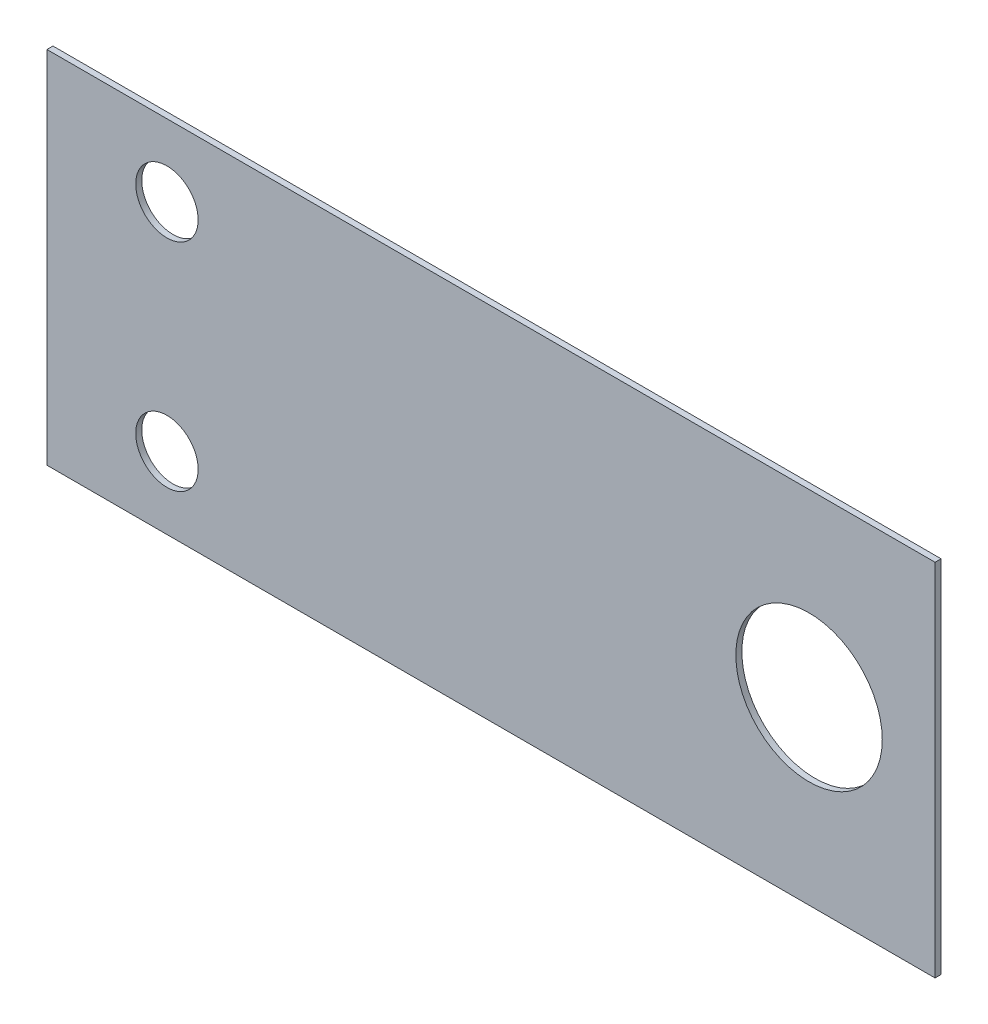
ISO-10303-21;
HEADER;
FILE_DESCRIPTION(('STEP AP214'),'2;1');
FILE_NAME('part.step','',(''),(''),'','','');
FILE_SCHEMA(('AUTOMOTIVE_DESIGN { 1 0 10303 214 1 1 1 1 }'));
ENDSEC;
DATA;
#1=APPLICATION_CONTEXT('core data for automotive mechanical design processes');
#2=APPLICATION_PROTOCOL_DEFINITION('international standard','automotive_design',2000,#1);
#3=PRODUCT_CONTEXT('',#1,'mechanical');
#4=PRODUCT('Part','Part','',(#3));
#5=PRODUCT_RELATED_PRODUCT_CATEGORY('part','',(#4));
#6=PRODUCT_DEFINITION_FORMATION('','',#4);
#7=PRODUCT_DEFINITION_CONTEXT('part definition',#1,'design');
#8=PRODUCT_DEFINITION('design','',#6,#7);
#9=PRODUCT_DEFINITION_SHAPE('','',#8);
#10=(LENGTH_UNIT() NAMED_UNIT(*) SI_UNIT(.MILLI.,.METRE.));
#11=(NAMED_UNIT(*) PLANE_ANGLE_UNIT() SI_UNIT($,.RADIAN.));
#12=(NAMED_UNIT(*) SI_UNIT($,.STERADIAN.) SOLID_ANGLE_UNIT());
#13=UNCERTAINTY_MEASURE_WITH_UNIT(LENGTH_MEASURE(1.E-05),#10,'distance_accuracy_value','');
#14=(GEOMETRIC_REPRESENTATION_CONTEXT(3) GLOBAL_UNCERTAINTY_ASSIGNED_CONTEXT((#13)) GLOBAL_UNIT_ASSIGNED_CONTEXT((#10,
#11,#12)) REPRESENTATION_CONTEXT('',''));
#15=CARTESIAN_POINT('',(0.,0.,0.));
#16=DIRECTION('',(0.,0.,1.));
#17=DIRECTION('',(1.,0.,0.));
#18=AXIS2_PLACEMENT_3D('',#15,#16,#17);
#19=CARTESIAN_POINT('',(37.,-15.,0.5));
#20=DIRECTION('',(-1.,0.,0.));
#21=DIRECTION('',(0.,0.,1.));
#22=AXIS2_PLACEMENT_3D('',#19,#20,#21);
#23=PLANE('',#22);
#24=DIRECTION('',(0.,1.,0.));
#25=VECTOR('',#24,1.);
#26=CARTESIAN_POINT('',(37.,-15.,0.));
#27=LINE('',#26,#25);
#28=CARTESIAN_POINT('',(37.,-15.,0.));
#29=VERTEX_POINT('',#28);
#30=CARTESIAN_POINT('',(37.,15.,0.));
#31=VERTEX_POINT('',#30);
#32=EDGE_CURVE('E99',#29,#31,#27,.T.);
#33=ORIENTED_EDGE('',*,*,#32,.T.);
#34=DIRECTION('',(0.,0.,-1.));
#35=VECTOR('',#34,1.);
#36=CARTESIAN_POINT('',(37.,15.,0.5));
#37=LINE('',#36,#35);
#38=CARTESIAN_POINT('',(37.,15.,0.5));
#39=VERTEX_POINT('',#38);
#40=EDGE_CURVE('E11',#39,#31,#37,.T.);
#41=ORIENTED_EDGE('',*,*,#40,.F.);
#42=DIRECTION('',(0.,1.,0.));
#43=VECTOR('',#42,1.);
#44=CARTESIAN_POINT('',(37.,-15.,0.5));
#45=LINE('',#44,#43);
#46=CARTESIAN_POINT('',(37.,-15.,0.5));
#47=VERTEX_POINT('',#46);
#48=EDGE_CURVE('E87',#47,#39,#45,.T.);
#49=ORIENTED_EDGE('',*,*,#48,.F.);
#50=DIRECTION('',(0.,0.,-1.));
#51=VECTOR('',#50,1.);
#52=CARTESIAN_POINT('',(37.,-15.,0.5));
#53=LINE('',#52,#51);
#54=EDGE_CURVE('E95',#47,#29,#53,.T.);
#55=ORIENTED_EDGE('',*,*,#54,.T.);
#56=EDGE_LOOP('',(#33,#41,#49,#55));
#57=FACE_BOUND('',#56,.T.);
#58=ADVANCED_FACE('F36',(#57),#23,.F.);
#59=CARTESIAN_POINT('',(-37.,15.,0.5));
#60=DIRECTION('',(0.,-1.,0.));
#61=DIRECTION('',(0.,0.,-1.));
#62=AXIS2_PLACEMENT_3D('',#59,#60,#61);
#63=PLANE('',#62);
#64=DIRECTION('',(-1.,0.,0.));
#65=VECTOR('',#64,1.);
#66=CARTESIAN_POINT('',(-37.,15.,0.));
#67=LINE('',#66,#65);
#68=CARTESIAN_POINT('',(-37.,15.,0.));
#69=VERTEX_POINT('',#68);
#70=EDGE_CURVE('E91',#31,#69,#67,.T.);
#71=ORIENTED_EDGE('',*,*,#70,.T.);
#72=DIRECTION('',(0.,0.,-1.));
#73=VECTOR('',#72,1.);
#74=CARTESIAN_POINT('',(-37.,15.,0.5));
#75=LINE('',#74,#73);
#76=CARTESIAN_POINT('',(-37.,15.,0.5));
#77=VERTEX_POINT('',#76);
#78=EDGE_CURVE('E44',#77,#69,#75,.T.);
#79=ORIENTED_EDGE('',*,*,#78,.F.);
#80=DIRECTION('',(-1.,0.,0.));
#81=VECTOR('',#80,1.);
#82=CARTESIAN_POINT('',(-37.,15.,0.5));
#83=LINE('',#82,#81);
#84=EDGE_CURVE('E82',#39,#77,#83,.T.);
#85=ORIENTED_EDGE('',*,*,#84,.F.);
#86=ORIENTED_EDGE('',*,*,#40,.T.);
#87=EDGE_LOOP('',(#71,#79,#85,#86));
#88=FACE_BOUND('',#87,.T.);
#89=ADVANCED_FACE('F90',(#88),#63,.F.);
#90=CARTESIAN_POINT('',(-37.,-15.,0.5));
#91=DIRECTION('',(1.,0.,0.));
#92=DIRECTION('',(0.,0.,-1.));
#93=AXIS2_PLACEMENT_3D('',#90,#91,#92);
#94=PLANE('',#93);
#95=DIRECTION('',(0.,-1.,0.));
#96=VECTOR('',#95,1.);
#97=CARTESIAN_POINT('',(-37.,-15.,0.));
#98=LINE('',#97,#96);
#99=CARTESIAN_POINT('',(-37.,-15.,0.));
#100=VERTEX_POINT('',#99);
#101=EDGE_CURVE('E69',#69,#100,#98,.T.);
#102=ORIENTED_EDGE('',*,*,#101,.T.);
#103=DIRECTION('',(0.,0.,-1.));
#104=VECTOR('',#103,1.);
#105=CARTESIAN_POINT('',(-37.,-15.,0.5));
#106=LINE('',#105,#104);
#107=CARTESIAN_POINT('',(-37.,-15.,0.5));
#108=VERTEX_POINT('',#107);
#109=EDGE_CURVE('E92',#108,#100,#106,.T.);
#110=ORIENTED_EDGE('',*,*,#109,.F.);
#111=DIRECTION('',(0.,-1.,0.));
#112=VECTOR('',#111,1.);
#113=CARTESIAN_POINT('',(-37.,-15.,0.5));
#114=LINE('',#113,#112);
#115=EDGE_CURVE('E85',#77,#108,#114,.T.);
#116=ORIENTED_EDGE('',*,*,#115,.F.);
#117=ORIENTED_EDGE('',*,*,#78,.T.);
#118=EDGE_LOOP('',(#102,#110,#116,#117));
#119=FACE_BOUND('',#118,.T.);
#120=ADVANCED_FACE('F93',(#119),#94,.F.);
#121=CARTESIAN_POINT('',(-37.,-15.,0.5));
#122=DIRECTION('',(0.,1.,0.));
#123=DIRECTION('',(0.,0.,1.));
#124=AXIS2_PLACEMENT_3D('',#121,#122,#123);
#125=PLANE('',#124);
#126=DIRECTION('',(1.,0.,0.));
#127=VECTOR('',#126,1.);
#128=CARTESIAN_POINT('',(-37.,-15.,0.));
#129=LINE('',#128,#127);
#130=EDGE_CURVE('E75',#100,#29,#129,.T.);
#131=ORIENTED_EDGE('',*,*,#130,.T.);
#132=ORIENTED_EDGE('',*,*,#54,.F.);
#133=DIRECTION('',(1.,0.,0.));
#134=VECTOR('',#133,1.);
#135=CARTESIAN_POINT('',(-37.,-15.,0.5));
#136=LINE('',#135,#134);
#137=EDGE_CURVE('E52',#108,#47,#136,.T.);
#138=ORIENTED_EDGE('',*,*,#137,.F.);
#139=ORIENTED_EDGE('',*,*,#109,.T.);
#140=EDGE_LOOP('',(#131,#132,#138,#139));
#141=FACE_BOUND('',#140,.T.);
#142=ADVANCED_FACE('F107',(#141),#125,.F.);
#143=CARTESIAN_POINT('',(0.,0.,0.5));
#144=DIRECTION('',(0.,0.,-1.));
#145=DIRECTION('',(-1.,0.,0.));
#146=AXIS2_PLACEMENT_3D('',#143,#144,#145);
#147=PLANE('',#146);
#148=CARTESIAN_POINT('',(26.5,0.,0.5));
#149=DIRECTION('',(0.,0.,1.));
#150=DIRECTION('',(1.,0.,0.));
#151=AXIS2_PLACEMENT_3D('',#148,#149,#150);
#152=CIRCLE('',#151,6.1);
#153=CARTESIAN_POINT('',(32.6,0.,0.5));
#154=VERTEX_POINT('',#153);
#155=EDGE_CURVE('E127',#154,#154,#152,.T.);
#156=ORIENTED_EDGE('',*,*,#155,.F.);
#157=EDGE_LOOP('',(#156));
#158=FACE_BOUND('',#157,.T.);
#159=CARTESIAN_POINT('',(-27.,-9.,0.500000000000001));
#160=DIRECTION('',(0.,0.,1.));
#161=DIRECTION('',(1.,0.,0.));
#162=AXIS2_PLACEMENT_3D('',#159,#160,#161);
#163=CIRCLE('',#162,2.59999999999999);
#164=CARTESIAN_POINT('',(-24.4,-9.,0.500000000000001));
#165=VERTEX_POINT('',#164);
#166=EDGE_CURVE('E121',#165,#165,#163,.T.);
#167=ORIENTED_EDGE('',*,*,#166,.F.);
#168=EDGE_LOOP('',(#167));
#169=FACE_BOUND('',#168,.T.);
#170=CARTESIAN_POINT('',(-27.,9.,0.500000000000001));
#171=DIRECTION('',(0.,0.,1.));
#172=DIRECTION('',(1.,0.,0.));
#173=AXIS2_PLACEMENT_3D('',#170,#171,#172);
#174=CIRCLE('',#173,2.59999999999999);
#175=CARTESIAN_POINT('',(-24.4,9.,0.500000000000001));
#176=VERTEX_POINT('',#175);
#177=EDGE_CURVE('E115',#176,#176,#174,.T.);
#178=ORIENTED_EDGE('',*,*,#177,.F.);
#179=EDGE_LOOP('',(#178));
#180=FACE_BOUND('',#179,.T.);
#181=ORIENTED_EDGE('',*,*,#48,.T.);
#182=ORIENTED_EDGE('',*,*,#84,.T.);
#183=ORIENTED_EDGE('',*,*,#115,.T.);
#184=ORIENTED_EDGE('',*,*,#137,.T.);
#185=EDGE_LOOP('',(#181,#182,#183,#184));
#186=FACE_BOUND('',#185,.T.);
#187=ADVANCED_FACE('F83',(#158,#169,#180,#186),#147,.F.);
#188=CARTESIAN_POINT('',(0.,0.,0.));
#189=DIRECTION('',(0.,0.,-1.));
#190=DIRECTION('',(-1.,0.,0.));
#191=AXIS2_PLACEMENT_3D('',#188,#189,#190);
#192=PLANE('',#191);
#193=CARTESIAN_POINT('',(26.5,0.,0.));
#194=DIRECTION('',(0.,0.,1.));
#195=DIRECTION('',(1.,0.,0.));
#196=AXIS2_PLACEMENT_3D('',#193,#194,#195);
#197=CIRCLE('',#196,6.1);
#198=CARTESIAN_POINT('',(32.6,0.,0.));
#199=VERTEX_POINT('',#198);
#200=EDGE_CURVE('E124',#199,#199,#197,.T.);
#201=ORIENTED_EDGE('',*,*,#200,.T.);
#202=EDGE_LOOP('',(#201));
#203=FACE_BOUND('',#202,.T.);
#204=CARTESIAN_POINT('',(-27.,-9.,0.));
#205=DIRECTION('',(0.,0.,1.));
#206=DIRECTION('',(1.,0.,0.));
#207=AXIS2_PLACEMENT_3D('',#204,#205,#206);
#208=CIRCLE('',#207,2.6);
#209=CARTESIAN_POINT('',(-24.4,-9.,0.));
#210=VERTEX_POINT('',#209);
#211=EDGE_CURVE('E118',#210,#210,#208,.T.);
#212=ORIENTED_EDGE('',*,*,#211,.T.);
#213=EDGE_LOOP('',(#212));
#214=FACE_BOUND('',#213,.T.);
#215=CARTESIAN_POINT('',(-27.,9.,0.));
#216=DIRECTION('',(0.,0.,1.));
#217=DIRECTION('',(1.,0.,0.));
#218=AXIS2_PLACEMENT_3D('',#215,#216,#217);
#219=CIRCLE('',#218,2.6);
#220=CARTESIAN_POINT('',(-24.4,9.,0.));
#221=VERTEX_POINT('',#220);
#222=EDGE_CURVE('E102',#221,#221,#219,.T.);
#223=ORIENTED_EDGE('',*,*,#222,.T.);
#224=EDGE_LOOP('',(#223));
#225=FACE_BOUND('',#224,.T.);
#226=ORIENTED_EDGE('',*,*,#32,.F.);
#227=ORIENTED_EDGE('',*,*,#130,.F.);
#228=ORIENTED_EDGE('',*,*,#101,.F.);
#229=ORIENTED_EDGE('',*,*,#70,.F.);
#230=EDGE_LOOP('',(#226,#227,#228,#229));
#231=FACE_BOUND('',#230,.T.);
#232=ADVANCED_FACE('F110',(#203,#214,#225,#231),#192,.T.);
#233=CARTESIAN_POINT('',(-27.,9.,0.5));
#234=DIRECTION('',(0.,0.,1.));
#235=DIRECTION('',(1.,0.,0.));
#236=AXIS2_PLACEMENT_3D('',#233,#234,#235);
#237=CYLINDRICAL_SURFACE('',#236,2.59999999999999);
#238=ORIENTED_EDGE('',*,*,#222,.F.);
#239=EDGE_LOOP('',(#238));
#240=FACE_BOUND('',#239,.T.);
#241=ORIENTED_EDGE('',*,*,#177,.T.);
#242=EDGE_LOOP('',(#241));
#243=FACE_BOUND('',#242,.T.);
#244=ADVANCED_FACE('F140',(#240,#243),#237,.F.);
#245=CARTESIAN_POINT('',(-27.,-9.,0.5));
#246=DIRECTION('',(0.,0.,1.));
#247=DIRECTION('',(1.,0.,0.));
#248=AXIS2_PLACEMENT_3D('',#245,#246,#247);
#249=CYLINDRICAL_SURFACE('',#248,2.59999999999999);
#250=ORIENTED_EDGE('',*,*,#211,.F.);
#251=EDGE_LOOP('',(#250));
#252=FACE_BOUND('',#251,.T.);
#253=ORIENTED_EDGE('',*,*,#166,.T.);
#254=EDGE_LOOP('',(#253));
#255=FACE_BOUND('',#254,.T.);
#256=ADVANCED_FACE('F142',(#252,#255),#249,.F.);
#257=CARTESIAN_POINT('',(26.5,0.,0.5));
#258=DIRECTION('',(0.,0.,1.));
#259=DIRECTION('',(1.,0.,0.));
#260=AXIS2_PLACEMENT_3D('',#257,#258,#259);
#261=CYLINDRICAL_SURFACE('',#260,6.1);
#262=ORIENTED_EDGE('',*,*,#200,.F.);
#263=EDGE_LOOP('',(#262));
#264=FACE_BOUND('',#263,.T.);
#265=ORIENTED_EDGE('',*,*,#155,.T.);
#266=EDGE_LOOP('',(#265));
#267=FACE_BOUND('',#266,.T.);
#268=ADVANCED_FACE('F131',(#264,#267),#261,.F.);
#269=CLOSED_SHELL('',(#58,#89,#120,#142,#187,#232,#244,#256,#268));
#270=MANIFOLD_SOLID_BREP('B2',#269);
#271=ADVANCED_BREP_SHAPE_REPRESENTATION('',(#18,#270),#14);
#272=SHAPE_DEFINITION_REPRESENTATION(#9,#271);
ENDSEC;
END-ISO-10303-21;
